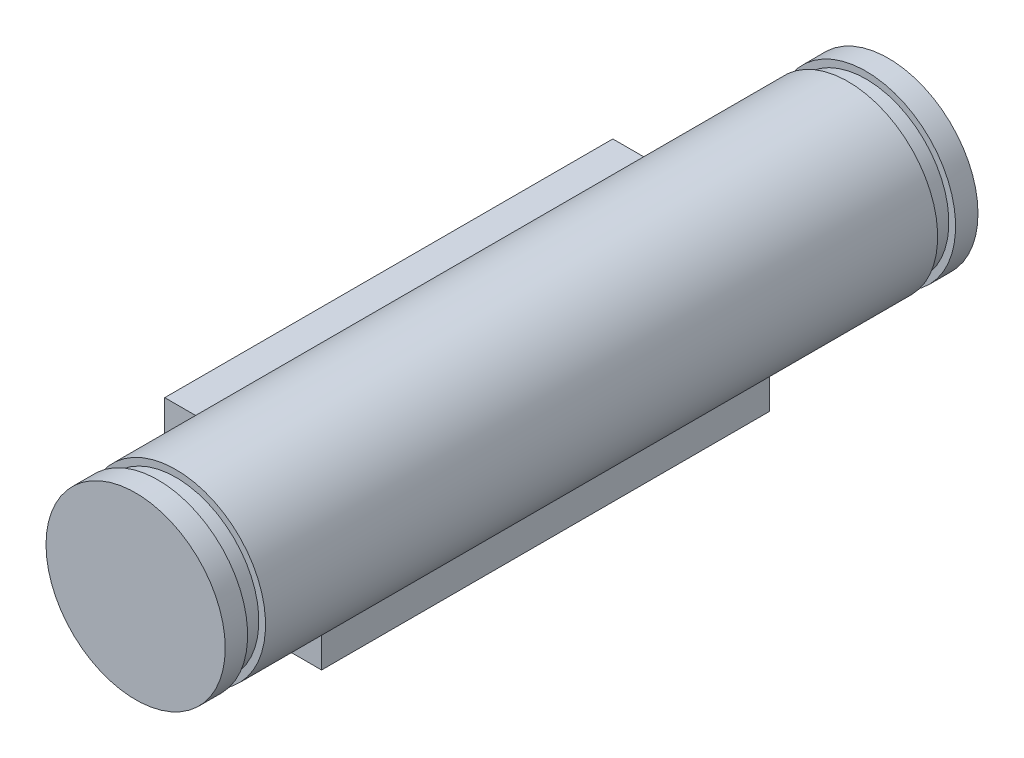
ISO-10303-21;
HEADER;
FILE_DESCRIPTION(('STEP AP214'),'2;1');
FILE_NAME('part.step','',(''),(''),'','','');
FILE_SCHEMA(('AUTOMOTIVE_DESIGN { 1 0 10303 214 1 1 1 1 }'));
ENDSEC;
DATA;
#1=APPLICATION_CONTEXT('core data for automotive mechanical design processes');
#2=APPLICATION_PROTOCOL_DEFINITION('international standard','automotive_design',2000,#1);
#3=PRODUCT_CONTEXT('',#1,'mechanical');
#4=PRODUCT('Part','Part','',(#3));
#5=PRODUCT_RELATED_PRODUCT_CATEGORY('part','',(#4));
#6=PRODUCT_DEFINITION_FORMATION('','',#4);
#7=PRODUCT_DEFINITION_CONTEXT('part definition',#1,'design');
#8=PRODUCT_DEFINITION('design','',#6,#7);
#9=PRODUCT_DEFINITION_SHAPE('','',#8);
#10=(LENGTH_UNIT() NAMED_UNIT(*) SI_UNIT(.MILLI.,.METRE.));
#11=(NAMED_UNIT(*) PLANE_ANGLE_UNIT() SI_UNIT($,.RADIAN.));
#12=(NAMED_UNIT(*) SI_UNIT($,.STERADIAN.) SOLID_ANGLE_UNIT());
#13=UNCERTAINTY_MEASURE_WITH_UNIT(LENGTH_MEASURE(1.E-05),#10,'distance_accuracy_value','');
#14=(GEOMETRIC_REPRESENTATION_CONTEXT(3) GLOBAL_UNCERTAINTY_ASSIGNED_CONTEXT((#13)) GLOBAL_UNIT_ASSIGNED_CONTEXT((#10,
#11,#12)) REPRESENTATION_CONTEXT('',''));
#15=CARTESIAN_POINT('',(0.,0.,0.));
#16=DIRECTION('',(0.,0.,1.));
#17=DIRECTION('',(1.,0.,0.));
#18=AXIS2_PLACEMENT_3D('',#15,#16,#17);
#19=CARTESIAN_POINT('',(0.,0.,16.8));
#20=DIRECTION('',(0.,0.,-1.));
#21=DIRECTION('',(-1.,0.,0.));
#22=AXIS2_PLACEMENT_3D('',#19,#20,#21);
#23=CYLINDRICAL_SURFACE('',#22,4.);
#24=DIRECTION('',(0.,0.,-1.));
#25=VECTOR('',#24,1.);
#26=CARTESIAN_POINT('',(-1.52999999999999,-3.69582196540905,10.));
#27=LINE('',#26,#25);
#28=CARTESIAN_POINT('',(-1.52999999999999,-3.69582196540905,10.));
#29=VERTEX_POINT('',#28);
#30=CARTESIAN_POINT('',(-1.52999999999999,-3.69582196540905,-10.));
#31=VERTEX_POINT('',#30);
#32=EDGE_CURVE('E52',#29,#31,#27,.T.);
#33=ORIENTED_EDGE('',*,*,#32,.F.);
#34=CARTESIAN_POINT('',(0.,0.,10.));
#35=DIRECTION('',(0.,0.,1.));
#36=DIRECTION('',(1.,0.,0.));
#37=AXIS2_PLACEMENT_3D('',#34,#35,#36);
#38=CIRCLE('',#37,4.);
#39=CARTESIAN_POINT('',(1.50000000000001,-3.70809924354783,10.));
#40=VERTEX_POINT('',#39);
#41=EDGE_CURVE('E45',#29,#40,#38,.T.);
#42=ORIENTED_EDGE('',*,*,#41,.T.);
#43=DIRECTION('',(0.,0.,-1.));
#44=VECTOR('',#43,1.);
#45=CARTESIAN_POINT('',(1.50000000000001,-3.70809924354783,10.));
#46=LINE('',#45,#44);
#47=CARTESIAN_POINT('',(1.50000000000001,-3.70809924354783,-10.));
#48=VERTEX_POINT('',#47);
#49=EDGE_CURVE('E152',#40,#48,#46,.T.);
#50=ORIENTED_EDGE('',*,*,#49,.T.);
#51=CARTESIAN_POINT('',(0.,0.,-10.));
#52=DIRECTION('',(0.,0.,1.));
#53=DIRECTION('',(1.,0.,0.));
#54=AXIS2_PLACEMENT_3D('',#51,#52,#53);
#55=CIRCLE('',#54,4.);
#56=EDGE_CURVE('E184',#31,#48,#55,.T.);
#57=ORIENTED_EDGE('',*,*,#56,.F.);
#58=EDGE_LOOP('',(#33,#42,#50,#57));
#59=FACE_BOUND('',#58,.T.);
#60=CARTESIAN_POINT('',(-3.69582196540905,1.53,10.));
#61=VERTEX_POINT('',#60);
#62=CARTESIAN_POINT('',(-3.70809924354783,-1.5,10.));
#63=VERTEX_POINT('',#62);
#64=EDGE_CURVE('E11',#61,#63,#38,.T.);
#65=ORIENTED_EDGE('',*,*,#64,.T.);
#66=DIRECTION('',(0.,0.,-1.));
#67=VECTOR('',#66,1.);
#68=CARTESIAN_POINT('',(-3.70809924354783,-1.5,10.));
#69=LINE('',#68,#67);
#70=CARTESIAN_POINT('',(-3.70809924354783,-1.5,-10.));
#71=VERTEX_POINT('',#70);
#72=EDGE_CURVE('E129',#63,#71,#69,.T.);
#73=ORIENTED_EDGE('',*,*,#72,.T.);
#74=CARTESIAN_POINT('',(-3.69582196540905,1.53,-10.));
#75=VERTEX_POINT('',#74);
#76=EDGE_CURVE('E186',#75,#71,#55,.T.);
#77=ORIENTED_EDGE('',*,*,#76,.F.);
#78=DIRECTION('',(0.,0.,-1.));
#79=VECTOR('',#78,1.);
#80=CARTESIAN_POINT('',(-3.69582196540905,1.53,10.));
#81=LINE('',#80,#79);
#82=EDGE_CURVE('E149',#61,#75,#81,.T.);
#83=ORIENTED_EDGE('',*,*,#82,.F.);
#84=EDGE_LOOP('',(#65,#73,#77,#83));
#85=FACE_BOUND('',#84,.T.);
#86=CARTESIAN_POINT('',(0.,0.,15.));
#87=DIRECTION('',(0.,0.,-1.));
#88=DIRECTION('',(-1.,0.,0.));
#89=AXIS2_PLACEMENT_3D('',#86,#87,#88);
#90=CIRCLE('',#89,4.);
#91=CARTESIAN_POINT('',(-4.,0.,15.));
#92=VERTEX_POINT('',#91);
#93=EDGE_CURVE('E168',#92,#92,#90,.T.);
#94=ORIENTED_EDGE('',*,*,#93,.T.);
#95=EDGE_LOOP('',(#94));
#96=FACE_BOUND('',#95,.T.);
#97=CARTESIAN_POINT('',(0.,0.,-15.));
#98=DIRECTION('',(0.,0.,-1.));
#99=DIRECTION('',(-1.,0.,0.));
#100=AXIS2_PLACEMENT_3D('',#97,#98,#99);
#101=CIRCLE('',#100,4.);
#102=CARTESIAN_POINT('',(-4.,0.,-15.));
#103=VERTEX_POINT('',#102);
#104=EDGE_CURVE('E159',#103,#103,#101,.T.);
#105=ORIENTED_EDGE('',*,*,#104,.F.);
#106=EDGE_LOOP('',(#105));
#107=FACE_BOUND('',#106,.T.);
#108=ADVANCED_FACE('F37',(#59,#85,#96,#107),#23,.T.);
#109=CARTESIAN_POINT('',(0.,4.,15.));
#110=DIRECTION('',(0.,0.,-1.));
#111=DIRECTION('',(-1.,0.,0.));
#112=AXIS2_PLACEMENT_3D('',#109,#110,#111);
#113=PLANE('',#112);
#114=ORIENTED_EDGE('',*,*,#93,.F.);
#115=EDGE_LOOP('',(#114));
#116=FACE_BOUND('',#115,.T.);
#117=CARTESIAN_POINT('',(0.,0.,15.));
#118=DIRECTION('',(0.,0.,-1.));
#119=DIRECTION('',(-1.,0.,0.));
#120=AXIS2_PLACEMENT_3D('',#117,#118,#119);
#121=CIRCLE('',#120,3.7);
#122=CARTESIAN_POINT('',(-3.7,0.,15.));
#123=VERTEX_POINT('',#122);
#124=EDGE_CURVE('E177',#123,#123,#121,.T.);
#125=ORIENTED_EDGE('',*,*,#124,.T.);
#126=EDGE_LOOP('',(#125));
#127=FACE_BOUND('',#126,.T.);
#128=ADVANCED_FACE('F200',(#116,#127),#113,.F.);
#129=CARTESIAN_POINT('',(0.,0.,-18.8));
#130=DIRECTION('',(0.,0.,-1.));
#131=DIRECTION('',(-1.,0.,0.));
#132=AXIS2_PLACEMENT_3D('',#129,#130,#131);
#133=CYLINDRICAL_SURFACE('',#132,3.7);
#134=ORIENTED_EDGE('',*,*,#124,.F.);
#135=EDGE_LOOP('',(#134));
#136=FACE_BOUND('',#135,.T.);
#137=CARTESIAN_POINT('',(0.,0.,15.8));
#138=DIRECTION('',(0.,0.,-1.));
#139=DIRECTION('',(-1.,0.,0.));
#140=AXIS2_PLACEMENT_3D('',#137,#138,#139);
#141=CIRCLE('',#140,3.7);
#142=CARTESIAN_POINT('',(-3.7,0.,15.8));
#143=VERTEX_POINT('',#142);
#144=EDGE_CURVE('E174',#143,#143,#141,.T.);
#145=ORIENTED_EDGE('',*,*,#144,.T.);
#146=EDGE_LOOP('',(#145));
#147=FACE_BOUND('',#146,.T.);
#148=ADVANCED_FACE('F233',(#136,#147),#133,.T.);
#149=CARTESIAN_POINT('',(0.,3.7,15.8));
#150=DIRECTION('',(0.,0.,1.));
#151=DIRECTION('',(1.,0.,0.));
#152=AXIS2_PLACEMENT_3D('',#149,#150,#151);
#153=PLANE('',#152);
#154=ORIENTED_EDGE('',*,*,#144,.F.);
#155=EDGE_LOOP('',(#154));
#156=FACE_BOUND('',#155,.T.);
#157=CARTESIAN_POINT('',(0.,0.,15.8));
#158=DIRECTION('',(0.,0.,-1.));
#159=DIRECTION('',(-1.,0.,0.));
#160=AXIS2_PLACEMENT_3D('',#157,#158,#159);
#161=CIRCLE('',#160,4.);
#162=CARTESIAN_POINT('',(-4.,0.,15.8));
#163=VERTEX_POINT('',#162);
#164=EDGE_CURVE('E171',#163,#163,#161,.T.);
#165=ORIENTED_EDGE('',*,*,#164,.T.);
#166=EDGE_LOOP('',(#165));
#167=FACE_BOUND('',#166,.T.);
#168=ADVANCED_FACE('F229',(#156,#167),#153,.F.);
#169=CARTESIAN_POINT('',(0.,0.,16.8));
#170=DIRECTION('',(0.,0.,1.));
#171=DIRECTION('',(1.,0.,0.));
#172=AXIS2_PLACEMENT_3D('',#169,#170,#171);
#173=PLANE('',#172);
#174=CARTESIAN_POINT('',(0.,0.,16.8));
#175=DIRECTION('',(0.,0.,1.));
#176=DIRECTION('',(1.,0.,0.));
#177=AXIS2_PLACEMENT_3D('',#174,#175,#176);
#178=CIRCLE('',#177,4.);
#179=CARTESIAN_POINT('',(4.,0.,16.8));
#180=VERTEX_POINT('',#179);
#181=EDGE_CURVE('E181',#180,#180,#178,.T.);
#182=ORIENTED_EDGE('',*,*,#181,.T.);
#183=EDGE_LOOP('',(#182));
#184=FACE_BOUND('',#183,.T.);
#185=ADVANCED_FACE('F232',(#184),#173,.T.);
#186=ORIENTED_EDGE('',*,*,#164,.F.);
#187=EDGE_LOOP('',(#186));
#188=FACE_BOUND('',#187,.T.);
#189=ORIENTED_EDGE('',*,*,#181,.F.);
#190=EDGE_LOOP('',(#189));
#191=FACE_BOUND('',#190,.T.);
#192=ADVANCED_FACE('F39',(#188,#191),#23,.T.);
#193=CARTESIAN_POINT('',(0.,0.,-18.8));
#194=DIRECTION('',(0.,0.,-1.));
#195=DIRECTION('',(-1.,0.,0.));
#196=AXIS2_PLACEMENT_3D('',#193,#194,#195);
#197=CYLINDRICAL_SURFACE('',#196,3.7);
#198=CARTESIAN_POINT('',(0.,0.,-15.8));
#199=DIRECTION('',(0.,0.,-1.));
#200=DIRECTION('',(-1.,0.,0.));
#201=AXIS2_PLACEMENT_3D('',#198,#199,#200);
#202=CIRCLE('',#201,3.7);
#203=CARTESIAN_POINT('',(-3.7,0.,-15.8));
#204=VERTEX_POINT('',#203);
#205=EDGE_CURVE('E165',#204,#204,#202,.T.);
#206=ORIENTED_EDGE('',*,*,#205,.F.);
#207=EDGE_LOOP('',(#206));
#208=FACE_BOUND('',#207,.T.);
#209=CARTESIAN_POINT('',(0.,0.,-15.));
#210=DIRECTION('',(0.,0.,-1.));
#211=DIRECTION('',(-1.,0.,0.));
#212=AXIS2_PLACEMENT_3D('',#209,#210,#211);
#213=CIRCLE('',#212,3.7);
#214=CARTESIAN_POINT('',(-3.7,0.,-15.));
#215=VERTEX_POINT('',#214);
#216=EDGE_CURVE('E156',#215,#215,#213,.T.);
#217=ORIENTED_EDGE('',*,*,#216,.T.);
#218=EDGE_LOOP('',(#217));
#219=FACE_BOUND('',#218,.T.);
#220=ADVANCED_FACE('F219',(#208,#219),#197,.T.);
#221=CARTESIAN_POINT('',(0.,3.7,-15.8));
#222=DIRECTION('',(0.,0.,-1.));
#223=DIRECTION('',(-1.,0.,0.));
#224=AXIS2_PLACEMENT_3D('',#221,#222,#223);
#225=PLANE('',#224);
#226=CARTESIAN_POINT('',(0.,0.,-15.8));
#227=DIRECTION('',(0.,0.,-1.));
#228=DIRECTION('',(-1.,0.,0.));
#229=AXIS2_PLACEMENT_3D('',#226,#227,#228);
#230=CIRCLE('',#229,4.);
#231=CARTESIAN_POINT('',(-4.,0.,-15.8));
#232=VERTEX_POINT('',#231);
#233=EDGE_CURVE('E162',#232,#232,#230,.T.);
#234=ORIENTED_EDGE('',*,*,#233,.F.);
#235=EDGE_LOOP('',(#234));
#236=FACE_BOUND('',#235,.T.);
#237=ORIENTED_EDGE('',*,*,#205,.T.);
#238=EDGE_LOOP('',(#237));
#239=FACE_BOUND('',#238,.T.);
#240=ADVANCED_FACE('F211',(#236,#239),#225,.F.);
#241=CARTESIAN_POINT('',(0.,4.,-15.));
#242=DIRECTION('',(0.,0.,1.));
#243=DIRECTION('',(1.,0.,0.));
#244=AXIS2_PLACEMENT_3D('',#241,#242,#243);
#245=PLANE('',#244);
#246=ORIENTED_EDGE('',*,*,#216,.F.);
#247=EDGE_LOOP('',(#246));
#248=FACE_BOUND('',#247,.T.);
#249=ORIENTED_EDGE('',*,*,#104,.T.);
#250=EDGE_LOOP('',(#249));
#251=FACE_BOUND('',#250,.T.);
#252=ADVANCED_FACE('F208',(#248,#251),#245,.F.);
#253=CARTESIAN_POINT('',(0.,0.,-16.8));
#254=DIRECTION('',(0.,0.,1.));
#255=DIRECTION('',(1.,0.,0.));
#256=AXIS2_PLACEMENT_3D('',#253,#254,#255);
#257=PLANE('',#256);
#258=CARTESIAN_POINT('',(0.,0.,-16.8));
#259=DIRECTION('',(0.,0.,1.));
#260=DIRECTION('',(1.,0.,0.));
#261=AXIS2_PLACEMENT_3D('',#258,#259,#260);
#262=CIRCLE('',#261,4.);
#263=CARTESIAN_POINT('',(4.,0.,-16.8));
#264=VERTEX_POINT('',#263);
#265=EDGE_CURVE('E180',#264,#264,#262,.T.);
#266=ORIENTED_EDGE('',*,*,#265,.F.);
#267=EDGE_LOOP('',(#266));
#268=FACE_BOUND('',#267,.T.);
#269=ADVANCED_FACE('F210',(#268),#257,.F.);
#270=ORIENTED_EDGE('',*,*,#233,.T.);
#271=EDGE_LOOP('',(#270));
#272=FACE_BOUND('',#271,.T.);
#273=ORIENTED_EDGE('',*,*,#265,.T.);
#274=EDGE_LOOP('',(#273));
#275=FACE_BOUND('',#274,.T.);
#276=ADVANCED_FACE('F201',(#272,#275),#23,.T.);
#277=CARTESIAN_POINT('',(-1.52999999999998,-5.50000000000001,10.));
#278=DIRECTION('',(0.,1.,0.));
#279=DIRECTION('',(-1.,0.,0.));
#280=AXIS2_PLACEMENT_3D('',#277,#278,#279);
#281=PLANE('',#280);
#282=DIRECTION('',(1.,0.,0.));
#283=VECTOR('',#282,1.);
#284=CARTESIAN_POINT('',(-1.52999999999998,-5.50000000000001,-10.));
#285=LINE('',#284,#283);
#286=CARTESIAN_POINT('',(-1.52999999999998,-5.50000000000001,-10.));
#287=VERTEX_POINT('',#286);
#288=CARTESIAN_POINT('',(1.50000000000002,-5.5,-10.));
#289=VERTEX_POINT('',#288);
#290=EDGE_CURVE('E131',#287,#289,#285,.T.);
#291=ORIENTED_EDGE('',*,*,#290,.T.);
#292=DIRECTION('',(0.,0.,-1.));
#293=VECTOR('',#292,1.);
#294=CARTESIAN_POINT('',(1.50000000000002,-5.5,10.));
#295=LINE('',#294,#293);
#296=CARTESIAN_POINT('',(1.50000000000002,-5.5,10.));
#297=VERTEX_POINT('',#296);
#298=EDGE_CURVE('E113',#297,#289,#295,.T.);
#299=ORIENTED_EDGE('',*,*,#298,.F.);
#300=DIRECTION('',(1.,0.,0.));
#301=VECTOR('',#300,1.);
#302=CARTESIAN_POINT('',(-1.52999999999998,-5.50000000000001,10.));
#303=LINE('',#302,#301);
#304=CARTESIAN_POINT('',(-1.52999999999998,-5.50000000000001,10.));
#305=VERTEX_POINT('',#304);
#306=EDGE_CURVE('E101',#305,#297,#303,.T.);
#307=ORIENTED_EDGE('',*,*,#306,.F.);
#308=DIRECTION('',(0.,0.,-1.));
#309=VECTOR('',#308,1.);
#310=CARTESIAN_POINT('',(-1.52999999999998,-5.50000000000001,10.));
#311=LINE('',#310,#309);
#312=EDGE_CURVE('E107',#305,#287,#311,.T.);
#313=ORIENTED_EDGE('',*,*,#312,.T.);
#314=EDGE_LOOP('',(#291,#299,#307,#313));
#315=FACE_BOUND('',#314,.T.);
#316=ADVANCED_FACE('F115',(#315),#281,.F.);
#317=CARTESIAN_POINT('',(0.,0.,10.));
#318=DIRECTION('',(0.,0.,1.));
#319=DIRECTION('',(1.,0.,0.));
#320=AXIS2_PLACEMENT_3D('',#317,#318,#319);
#321=PLANE('',#320);
#322=ORIENTED_EDGE('',*,*,#41,.F.);
#323=DIRECTION('',(0.,-1.,0.));
#324=VECTOR('',#323,1.);
#325=CARTESIAN_POINT('',(-1.52999999999999,-3.69582196540905,10.));
#326=LINE('',#325,#324);
#327=EDGE_CURVE('E97',#29,#305,#326,.T.);
#328=ORIENTED_EDGE('',*,*,#327,.T.);
#329=ORIENTED_EDGE('',*,*,#306,.T.);
#330=DIRECTION('',(0.,1.,0.));
#331=VECTOR('',#330,1.);
#332=CARTESIAN_POINT('',(1.50000000000002,-5.5,10.));
#333=LINE('',#332,#331);
#334=EDGE_CURVE('E118',#297,#40,#333,.T.);
#335=ORIENTED_EDGE('',*,*,#334,.T.);
#336=EDGE_LOOP('',(#322,#328,#329,#335));
#337=FACE_BOUND('',#336,.T.);
#338=ADVANCED_FACE('F99',(#337),#321,.T.);
#339=CARTESIAN_POINT('',(0.,0.,-10.));
#340=DIRECTION('',(0.,0.,1.));
#341=DIRECTION('',(1.,0.,0.));
#342=AXIS2_PLACEMENT_3D('',#339,#340,#341);
#343=PLANE('',#342);
#344=DIRECTION('',(0.,-1.,0.));
#345=VECTOR('',#344,1.);
#346=CARTESIAN_POINT('',(-1.52999999999999,-3.69582196540905,-10.));
#347=LINE('',#346,#345);
#348=EDGE_CURVE('E110',#31,#287,#347,.T.);
#349=ORIENTED_EDGE('',*,*,#348,.F.);
#350=ORIENTED_EDGE('',*,*,#56,.T.);
#351=DIRECTION('',(0.,1.,0.));
#352=VECTOR('',#351,1.);
#353=CARTESIAN_POINT('',(1.50000000000002,-5.5,-10.));
#354=LINE('',#353,#352);
#355=EDGE_CURVE('E133',#289,#48,#354,.T.);
#356=ORIENTED_EDGE('',*,*,#355,.F.);
#357=ORIENTED_EDGE('',*,*,#290,.F.);
#358=EDGE_LOOP('',(#349,#350,#356,#357));
#359=FACE_BOUND('',#358,.T.);
#360=ADVANCED_FACE('F194',(#359),#343,.F.);
#361=CARTESIAN_POINT('',(1.50000000000002,-5.5,10.));
#362=DIRECTION('',(-1.,0.,0.));
#363=DIRECTION('',(0.,-1.,0.));
#364=AXIS2_PLACEMENT_3D('',#361,#362,#363);
#365=PLANE('',#364);
#366=ORIENTED_EDGE('',*,*,#355,.T.);
#367=ORIENTED_EDGE('',*,*,#49,.F.);
#368=ORIENTED_EDGE('',*,*,#334,.F.);
#369=ORIENTED_EDGE('',*,*,#298,.T.);
#370=EDGE_LOOP('',(#366,#367,#368,#369));
#371=FACE_BOUND('',#370,.T.);
#372=ADVANCED_FACE('F197',(#371),#365,.F.);
#373=CARTESIAN_POINT('',(-1.52999999999999,-3.69582196540905,10.));
#374=DIRECTION('',(1.,0.,0.));
#375=DIRECTION('',(0.,1.,0.));
#376=AXIS2_PLACEMENT_3D('',#373,#374,#375);
#377=PLANE('',#376);
#378=ORIENTED_EDGE('',*,*,#348,.T.);
#379=ORIENTED_EDGE('',*,*,#312,.F.);
#380=ORIENTED_EDGE('',*,*,#327,.F.);
#381=ORIENTED_EDGE('',*,*,#32,.T.);
#382=EDGE_LOOP('',(#378,#379,#380,#381));
#383=FACE_BOUND('',#382,.T.);
#384=ADVANCED_FACE('F108',(#383),#377,.F.);
#385=ORIENTED_EDGE('',*,*,#64,.F.);
#386=DIRECTION('',(-1.,0.,0.));
#387=VECTOR('',#386,1.);
#388=CARTESIAN_POINT('',(-3.69582196540905,1.53,10.));
#389=LINE('',#388,#387);
#390=CARTESIAN_POINT('',(-5.5,1.53,10.));
#391=VERTEX_POINT('',#390);
#392=EDGE_CURVE('E120',#61,#391,#389,.T.);
#393=ORIENTED_EDGE('',*,*,#392,.T.);
#394=DIRECTION('',(0.,-1.,0.));
#395=VECTOR('',#394,1.);
#396=CARTESIAN_POINT('',(-5.5,1.53,10.));
#397=LINE('',#396,#395);
#398=CARTESIAN_POINT('',(-5.5,-1.5,10.));
#399=VERTEX_POINT('',#398);
#400=EDGE_CURVE('E124',#391,#399,#397,.T.);
#401=ORIENTED_EDGE('',*,*,#400,.T.);
#402=DIRECTION('',(1.,0.,0.));
#403=VECTOR('',#402,1.);
#404=CARTESIAN_POINT('',(-5.5,-1.5,10.));
#405=LINE('',#404,#403);
#406=EDGE_CURVE('E126',#399,#63,#405,.T.);
#407=ORIENTED_EDGE('',*,*,#406,.T.);
#408=EDGE_LOOP('',(#385,#393,#401,#407));
#409=FACE_BOUND('',#408,.T.);
#410=ADVANCED_FACE('F267',(#409),#321,.T.);
#411=DIRECTION('',(-1.,0.,0.));
#412=VECTOR('',#411,1.);
#413=CARTESIAN_POINT('',(-3.69582196540905,1.53,-10.));
#414=LINE('',#413,#412);
#415=CARTESIAN_POINT('',(-5.5,1.53,-10.));
#416=VERTEX_POINT('',#415);
#417=EDGE_CURVE('E136',#75,#416,#414,.T.);
#418=ORIENTED_EDGE('',*,*,#417,.F.);
#419=ORIENTED_EDGE('',*,*,#76,.T.);
#420=DIRECTION('',(1.,0.,0.));
#421=VECTOR('',#420,1.);
#422=CARTESIAN_POINT('',(-5.5,-1.5,-10.));
#423=LINE('',#422,#421);
#424=CARTESIAN_POINT('',(-5.5,-1.5,-10.));
#425=VERTEX_POINT('',#424);
#426=EDGE_CURVE('E104',#425,#71,#423,.T.);
#427=ORIENTED_EDGE('',*,*,#426,.F.);
#428=DIRECTION('',(0.,-1.,0.));
#429=VECTOR('',#428,1.);
#430=CARTESIAN_POINT('',(-5.5,1.53,-10.));
#431=LINE('',#430,#429);
#432=EDGE_CURVE('E138',#416,#425,#431,.T.);
#433=ORIENTED_EDGE('',*,*,#432,.F.);
#434=EDGE_LOOP('',(#418,#419,#427,#433));
#435=FACE_BOUND('',#434,.T.);
#436=ADVANCED_FACE('F275',(#435),#343,.F.);
#437=CARTESIAN_POINT('',(-3.69582196540905,1.53,10.));
#438=DIRECTION('',(0.,-1.,0.));
#439=DIRECTION('',(1.,0.,0.));
#440=AXIS2_PLACEMENT_3D('',#437,#438,#439);
#441=PLANE('',#440);
#442=ORIENTED_EDGE('',*,*,#417,.T.);
#443=DIRECTION('',(0.,0.,-1.));
#444=VECTOR('',#443,1.);
#445=CARTESIAN_POINT('',(-5.5,1.53,10.));
#446=LINE('',#445,#444);
#447=EDGE_CURVE('E146',#391,#416,#446,.T.);
#448=ORIENTED_EDGE('',*,*,#447,.F.);
#449=ORIENTED_EDGE('',*,*,#392,.F.);
#450=ORIENTED_EDGE('',*,*,#82,.T.);
#451=EDGE_LOOP('',(#442,#448,#449,#450));
#452=FACE_BOUND('',#451,.T.);
#453=ADVANCED_FACE('F271',(#452),#441,.F.);
#454=CARTESIAN_POINT('',(-5.5,1.53,10.));
#455=DIRECTION('',(1.,0.,0.));
#456=DIRECTION('',(0.,0.,-1.));
#457=AXIS2_PLACEMENT_3D('',#454,#455,#456);
#458=PLANE('',#457);
#459=ORIENTED_EDGE('',*,*,#432,.T.);
#460=DIRECTION('',(0.,0.,-1.));
#461=VECTOR('',#460,1.);
#462=CARTESIAN_POINT('',(-5.5,-1.5,10.));
#463=LINE('',#462,#461);
#464=EDGE_CURVE('E143',#399,#425,#463,.T.);
#465=ORIENTED_EDGE('',*,*,#464,.F.);
#466=ORIENTED_EDGE('',*,*,#400,.F.);
#467=ORIENTED_EDGE('',*,*,#447,.T.);
#468=EDGE_LOOP('',(#459,#465,#466,#467));
#469=FACE_BOUND('',#468,.T.);
#470=ADVANCED_FACE('F274',(#469),#458,.F.);
#471=CARTESIAN_POINT('',(-5.5,-1.5,10.));
#472=DIRECTION('',(0.,1.,0.));
#473=DIRECTION('',(0.,0.,1.));
#474=AXIS2_PLACEMENT_3D('',#471,#472,#473);
#475=PLANE('',#474);
#476=ORIENTED_EDGE('',*,*,#426,.T.);
#477=ORIENTED_EDGE('',*,*,#72,.F.);
#478=ORIENTED_EDGE('',*,*,#406,.F.);
#479=ORIENTED_EDGE('',*,*,#464,.T.);
#480=EDGE_LOOP('',(#476,#477,#478,#479));
#481=FACE_BOUND('',#480,.T.);
#482=ADVANCED_FACE('F279',(#481),#475,.F.);
#483=CLOSED_SHELL('',(#108,#128,#148,#168,#185,#192,#220,#240,#252,#269,#276,#316,#338,#360,
#372,#384,#410,#436,#453,#470,#482));
#484=MANIFOLD_SOLID_BREP('B2',#483);
#485=ADVANCED_BREP_SHAPE_REPRESENTATION('',(#18,#484),#14);
#486=SHAPE_DEFINITION_REPRESENTATION(#9,#485);
ENDSEC;
END-ISO-10303-21;
